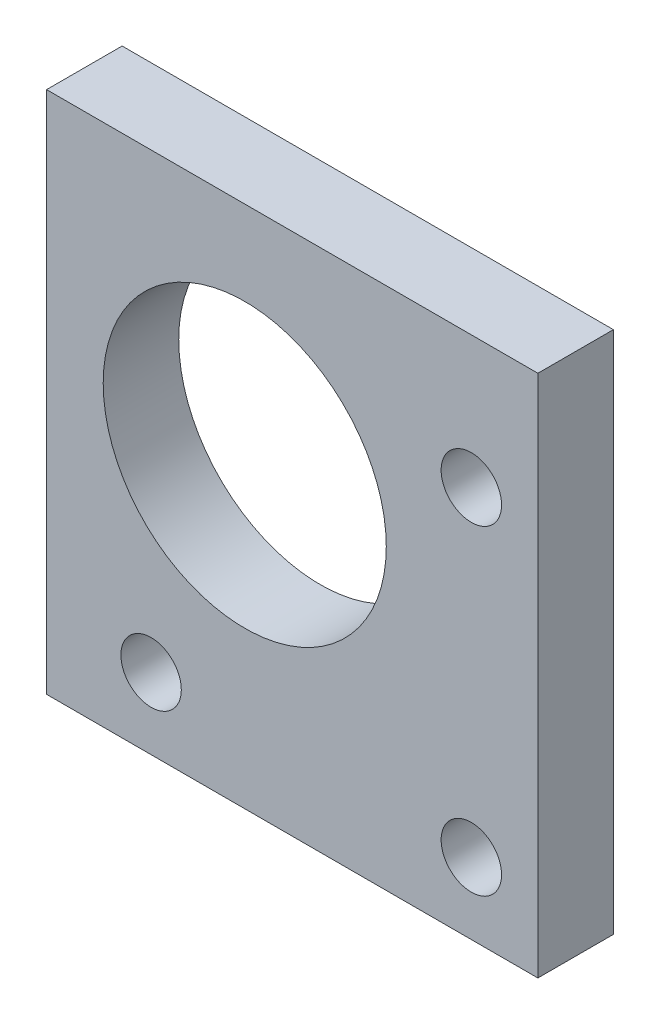
ISO-10303-21;
HEADER;
FILE_DESCRIPTION(('STEP AP214'),'2;1');
FILE_NAME('part.step','',(''),(''),'','','');
FILE_SCHEMA(('AUTOMOTIVE_DESIGN { 1 0 10303 214 1 1 1 1 }'));
ENDSEC;
DATA;
#1=APPLICATION_CONTEXT('core data for automotive mechanical design processes');
#2=APPLICATION_PROTOCOL_DEFINITION('international standard','automotive_design',2000,#1);
#3=PRODUCT_CONTEXT('',#1,'mechanical');
#4=PRODUCT('Part','Part','',(#3));
#5=PRODUCT_RELATED_PRODUCT_CATEGORY('part','',(#4));
#6=PRODUCT_DEFINITION_FORMATION('','',#4);
#7=PRODUCT_DEFINITION_CONTEXT('part definition',#1,'design');
#8=PRODUCT_DEFINITION('design','',#6,#7);
#9=PRODUCT_DEFINITION_SHAPE('','',#8);
#10=(LENGTH_UNIT() NAMED_UNIT(*) SI_UNIT(.MILLI.,.METRE.));
#11=(NAMED_UNIT(*) PLANE_ANGLE_UNIT() SI_UNIT($,.RADIAN.));
#12=(NAMED_UNIT(*) SI_UNIT($,.STERADIAN.) SOLID_ANGLE_UNIT());
#13=UNCERTAINTY_MEASURE_WITH_UNIT(LENGTH_MEASURE(1.E-05),#10,'distance_accuracy_value','');
#14=(GEOMETRIC_REPRESENTATION_CONTEXT(3) GLOBAL_UNCERTAINTY_ASSIGNED_CONTEXT((#13)) GLOBAL_UNIT_ASSIGNED_CONTEXT((#10,
#11,#12)) REPRESENTATION_CONTEXT('',''));
#15=CARTESIAN_POINT('',(0.,0.,0.));
#16=DIRECTION('',(0.,0.,1.));
#17=DIRECTION('',(1.,0.,0.));
#18=AXIS2_PLACEMENT_3D('',#15,#16,#17);
#19=CARTESIAN_POINT('',(0.,0.,6.35));
#20=DIRECTION('',(0.,0.,1.));
#21=DIRECTION('',(1.,0.,0.));
#22=AXIS2_PLACEMENT_3D('',#19,#20,#21);
#23=PLANE('',#22);
#24=CARTESIAN_POINT('',(19.05,-19.05,6.35));
#25=DIRECTION('',(0.,0.,1.));
#26=DIRECTION('',(1.,0.,0.));
#27=AXIS2_PLACEMENT_3D('',#24,#25,#26);
#28=CIRCLE('',#27,2.54);
#29=CARTESIAN_POINT('',(21.59,-19.05,6.35));
#30=VERTEX_POINT('',#29);
#31=EDGE_CURVE('E122',#30,#30,#28,.T.);
#32=ORIENTED_EDGE('',*,*,#31,.F.);
#33=EDGE_LOOP('',(#32));
#34=FACE_BOUND('',#33,.T.);
#35=CARTESIAN_POINT('',(0.,0.,6.35));
#36=DIRECTION('',(0.,0.,1.));
#37=DIRECTION('',(1.,0.,0.));
#38=AXIS2_PLACEMENT_3D('',#35,#36,#37);
#39=CIRCLE('',#38,11.8999);
#40=CARTESIAN_POINT('',(11.8999,0.,6.35));
#41=VERTEX_POINT('',#40);
#42=EDGE_CURVE('E101',#41,#41,#39,.T.);
#43=ORIENTED_EDGE('',*,*,#42,.F.);
#44=EDGE_LOOP('',(#43));
#45=FACE_BOUND('',#44,.T.);
#46=DIRECTION('',(0.,1.,0.));
#47=VECTOR('',#46,1.);
#48=CARTESIAN_POINT('',(24.6441907260092,-25.0415711370855,6.35));
#49=LINE('',#48,#47);
#50=CARTESIAN_POINT('',(24.6441907260092,-25.0415711370855,6.35));
#51=VERTEX_POINT('',#50);
#52=CARTESIAN_POINT('',(24.6441907260092,18.9902397011958,6.35));
#53=VERTEX_POINT('',#52);
#54=EDGE_CURVE('E86',#51,#53,#49,.T.);
#55=ORIENTED_EDGE('',*,*,#54,.T.);
#56=DIRECTION('',(-1.,0.,0.));
#57=VECTOR('',#56,1.);
#58=CARTESIAN_POINT('',(24.6441907260092,18.9902397011958,6.35));
#59=LINE('',#58,#57);
#60=CARTESIAN_POINT('',(-16.659153201353,18.9902397011958,6.35));
#61=VERTEX_POINT('',#60);
#62=EDGE_CURVE('E81',#53,#61,#59,.T.);
#63=ORIENTED_EDGE('',*,*,#62,.T.);
#64=DIRECTION('',(0.,-1.,0.));
#65=VECTOR('',#64,1.);
#66=CARTESIAN_POINT('',(-16.659153201353,-25.0415711370855,6.35));
#67=LINE('',#66,#65);
#68=CARTESIAN_POINT('',(-16.659153201353,-25.0415711370855,6.35));
#69=VERTEX_POINT('',#68);
#70=EDGE_CURVE('E84',#61,#69,#67,.T.);
#71=ORIENTED_EDGE('',*,*,#70,.T.);
#72=DIRECTION('',(1.,0.,0.));
#73=VECTOR('',#72,1.);
#74=CARTESIAN_POINT('',(24.6441907260092,-25.0415711370855,6.35));
#75=LINE('',#74,#73);
#76=EDGE_CURVE('E51',#69,#51,#75,.T.);
#77=ORIENTED_EDGE('',*,*,#76,.T.);
#78=EDGE_LOOP('',(#55,#63,#71,#77));
#79=FACE_BOUND('',#78,.T.);
#80=CARTESIAN_POINT('',(19.05,7.874,6.35));
#81=DIRECTION('',(0.,0.,1.));
#82=DIRECTION('',(1.,0.,0.));
#83=AXIS2_PLACEMENT_3D('',#80,#81,#82);
#84=CIRCLE('',#83,2.54);
#85=CARTESIAN_POINT('',(21.59,7.874,6.35));
#86=VERTEX_POINT('',#85);
#87=EDGE_CURVE('E116',#86,#86,#84,.T.);
#88=ORIENTED_EDGE('',*,*,#87,.F.);
#89=EDGE_LOOP('',(#88));
#90=FACE_BOUND('',#89,.T.);
#91=CARTESIAN_POINT('',(-7.874,-19.05,6.35));
#92=DIRECTION('',(0.,0.,1.));
#93=DIRECTION('',(1.,0.,0.));
#94=AXIS2_PLACEMENT_3D('',#91,#92,#93);
#95=CIRCLE('',#94,2.54);
#96=CARTESIAN_POINT('',(-5.334,-19.05,6.35));
#97=VERTEX_POINT('',#96);
#98=EDGE_CURVE('E128',#97,#97,#95,.T.);
#99=ORIENTED_EDGE('',*,*,#98,.F.);
#100=EDGE_LOOP('',(#99));
#101=FACE_BOUND('',#100,.T.);
#102=ADVANCED_FACE('F34',(#34,#45,#79,#90,#101),#23,.T.);
#103=CARTESIAN_POINT('',(0.,0.,0.));
#104=DIRECTION('',(0.,0.,1.));
#105=DIRECTION('',(1.,0.,0.));
#106=AXIS2_PLACEMENT_3D('',#103,#104,#105);
#107=PLANE('',#106);
#108=CARTESIAN_POINT('',(19.05,-19.05,0.));
#109=DIRECTION('',(0.,0.,1.));
#110=DIRECTION('',(1.,0.,0.));
#111=AXIS2_PLACEMENT_3D('',#108,#109,#110);
#112=CIRCLE('',#111,2.54);
#113=CARTESIAN_POINT('',(21.59,-19.05,0.));
#114=VERTEX_POINT('',#113);
#115=EDGE_CURVE('E125',#114,#114,#112,.T.);
#116=ORIENTED_EDGE('',*,*,#115,.T.);
#117=EDGE_LOOP('',(#116));
#118=FACE_BOUND('',#117,.T.);
#119=CARTESIAN_POINT('',(0.,0.,0.));
#120=DIRECTION('',(0.,0.,1.));
#121=DIRECTION('',(1.,0.,0.));
#122=AXIS2_PLACEMENT_3D('',#119,#120,#121);
#123=CIRCLE('',#122,11.8999);
#124=CARTESIAN_POINT('',(11.8999,0.,0.));
#125=VERTEX_POINT('',#124);
#126=EDGE_CURVE('E113',#125,#125,#123,.T.);
#127=ORIENTED_EDGE('',*,*,#126,.T.);
#128=EDGE_LOOP('',(#127));
#129=FACE_BOUND('',#128,.T.);
#130=DIRECTION('',(0.,1.,0.));
#131=VECTOR('',#130,1.);
#132=CARTESIAN_POINT('',(24.6441907260092,-25.0415711370855,0.));
#133=LINE('',#132,#131);
#134=CARTESIAN_POINT('',(24.6441907260092,-25.0415711370855,0.));
#135=VERTEX_POINT('',#134);
#136=CARTESIAN_POINT('',(24.6441907260092,18.9902397011958,0.));
#137=VERTEX_POINT('',#136);
#138=EDGE_CURVE('E98',#135,#137,#133,.T.);
#139=ORIENTED_EDGE('',*,*,#138,.F.);
#140=DIRECTION('',(1.,0.,0.));
#141=VECTOR('',#140,1.);
#142=CARTESIAN_POINT('',(24.6441907260092,-25.0415711370855,0.));
#143=LINE('',#142,#141);
#144=CARTESIAN_POINT('',(-16.659153201353,-25.0415711370855,0.));
#145=VERTEX_POINT('',#144);
#146=EDGE_CURVE('E74',#145,#135,#143,.T.);
#147=ORIENTED_EDGE('',*,*,#146,.F.);
#148=DIRECTION('',(0.,-1.,0.));
#149=VECTOR('',#148,1.);
#150=CARTESIAN_POINT('',(-16.659153201353,-25.0415711370855,0.));
#151=LINE('',#150,#149);
#152=CARTESIAN_POINT('',(-16.659153201353,18.9902397011958,0.));
#153=VERTEX_POINT('',#152);
#154=EDGE_CURVE('E68',#153,#145,#151,.T.);
#155=ORIENTED_EDGE('',*,*,#154,.F.);
#156=DIRECTION('',(-1.,0.,0.));
#157=VECTOR('',#156,1.);
#158=CARTESIAN_POINT('',(24.6441907260092,18.9902397011958,0.));
#159=LINE('',#158,#157);
#160=EDGE_CURVE('E90',#137,#153,#159,.T.);
#161=ORIENTED_EDGE('',*,*,#160,.F.);
#162=EDGE_LOOP('',(#139,#147,#155,#161));
#163=FACE_BOUND('',#162,.T.);
#164=CARTESIAN_POINT('',(19.05,7.874,0.));
#165=DIRECTION('',(0.,0.,1.));
#166=DIRECTION('',(1.,0.,0.));
#167=AXIS2_PLACEMENT_3D('',#164,#165,#166);
#168=CIRCLE('',#167,2.54);
#169=CARTESIAN_POINT('',(21.59,7.874,0.));
#170=VERTEX_POINT('',#169);
#171=EDGE_CURVE('E119',#170,#170,#168,.T.);
#172=ORIENTED_EDGE('',*,*,#171,.T.);
#173=EDGE_LOOP('',(#172));
#174=FACE_BOUND('',#173,.T.);
#175=CARTESIAN_POINT('',(-7.874,-19.05,0.));
#176=DIRECTION('',(0.,0.,1.));
#177=DIRECTION('',(1.,0.,0.));
#178=AXIS2_PLACEMENT_3D('',#175,#176,#177);
#179=CIRCLE('',#178,2.54);
#180=CARTESIAN_POINT('',(-5.334,-19.05,0.));
#181=VERTEX_POINT('',#180);
#182=EDGE_CURVE('E131',#181,#181,#179,.T.);
#183=ORIENTED_EDGE('',*,*,#182,.T.);
#184=EDGE_LOOP('',(#183));
#185=FACE_BOUND('',#184,.T.);
#186=ADVANCED_FACE('F109',(#118,#129,#163,#174,#185),#107,.F.);
#187=CARTESIAN_POINT('',(24.6441907260092,-25.0415711370855,6.35));
#188=DIRECTION('',(-1.,0.,0.));
#189=DIRECTION('',(0.,0.,1.));
#190=AXIS2_PLACEMENT_3D('',#187,#188,#189);
#191=PLANE('',#190);
#192=ORIENTED_EDGE('',*,*,#138,.T.);
#193=DIRECTION('',(0.,0.,-1.));
#194=VECTOR('',#193,1.);
#195=CARTESIAN_POINT('',(24.6441907260092,18.9902397011958,6.35));
#196=LINE('',#195,#194);
#197=EDGE_CURVE('E11',#53,#137,#196,.T.);
#198=ORIENTED_EDGE('',*,*,#197,.F.);
#199=ORIENTED_EDGE('',*,*,#54,.F.);
#200=DIRECTION('',(0.,0.,-1.));
#201=VECTOR('',#200,1.);
#202=CARTESIAN_POINT('',(24.6441907260092,-25.0415711370855,6.35));
#203=LINE('',#202,#201);
#204=EDGE_CURVE('E94',#51,#135,#203,.T.);
#205=ORIENTED_EDGE('',*,*,#204,.T.);
#206=EDGE_LOOP('',(#192,#198,#199,#205));
#207=FACE_BOUND('',#206,.T.);
#208=ADVANCED_FACE('F36',(#207),#191,.F.);
#209=CARTESIAN_POINT('',(24.6441907260092,18.9902397011958,6.35));
#210=DIRECTION('',(0.,-1.,0.));
#211=DIRECTION('',(0.,0.,-1.));
#212=AXIS2_PLACEMENT_3D('',#209,#210,#211);
#213=PLANE('',#212);
#214=ORIENTED_EDGE('',*,*,#160,.T.);
#215=DIRECTION('',(0.,0.,-1.));
#216=VECTOR('',#215,1.);
#217=CARTESIAN_POINT('',(-16.659153201353,18.9902397011958,6.35));
#218=LINE('',#217,#216);
#219=EDGE_CURVE('E43',#61,#153,#218,.T.);
#220=ORIENTED_EDGE('',*,*,#219,.F.);
#221=ORIENTED_EDGE('',*,*,#62,.F.);
#222=ORIENTED_EDGE('',*,*,#197,.T.);
#223=EDGE_LOOP('',(#214,#220,#221,#222));
#224=FACE_BOUND('',#223,.T.);
#225=ADVANCED_FACE('F89',(#224),#213,.F.);
#226=CARTESIAN_POINT('',(-16.659153201353,-25.0415711370855,6.35));
#227=DIRECTION('',(1.,0.,0.));
#228=DIRECTION('',(0.,0.,-1.));
#229=AXIS2_PLACEMENT_3D('',#226,#227,#228);
#230=PLANE('',#229);
#231=ORIENTED_EDGE('',*,*,#154,.T.);
#232=DIRECTION('',(0.,0.,-1.));
#233=VECTOR('',#232,1.);
#234=CARTESIAN_POINT('',(-16.659153201353,-25.0415711370855,6.35));
#235=LINE('',#234,#233);
#236=EDGE_CURVE('E91',#69,#145,#235,.T.);
#237=ORIENTED_EDGE('',*,*,#236,.F.);
#238=ORIENTED_EDGE('',*,*,#70,.F.);
#239=ORIENTED_EDGE('',*,*,#219,.T.);
#240=EDGE_LOOP('',(#231,#237,#238,#239));
#241=FACE_BOUND('',#240,.T.);
#242=ADVANCED_FACE('F92',(#241),#230,.F.);
#243=CARTESIAN_POINT('',(24.6441907260092,-25.0415711370855,6.35));
#244=DIRECTION('',(0.,1.,0.));
#245=DIRECTION('',(0.,0.,1.));
#246=AXIS2_PLACEMENT_3D('',#243,#244,#245);
#247=PLANE('',#246);
#248=ORIENTED_EDGE('',*,*,#146,.T.);
#249=ORIENTED_EDGE('',*,*,#204,.F.);
#250=ORIENTED_EDGE('',*,*,#76,.F.);
#251=ORIENTED_EDGE('',*,*,#236,.T.);
#252=EDGE_LOOP('',(#248,#249,#250,#251));
#253=FACE_BOUND('',#252,.T.);
#254=ADVANCED_FACE('F106',(#253),#247,.F.);
#255=CARTESIAN_POINT('',(0.,0.,6.35));
#256=DIRECTION('',(0.,0.,-1.));
#257=DIRECTION('',(-1.,0.,0.));
#258=AXIS2_PLACEMENT_3D('',#255,#256,#257);
#259=CYLINDRICAL_SURFACE('',#258,11.8999);
#260=ORIENTED_EDGE('',*,*,#42,.T.);
#261=EDGE_LOOP('',(#260));
#262=FACE_BOUND('',#261,.T.);
#263=ORIENTED_EDGE('',*,*,#126,.F.);
#264=EDGE_LOOP('',(#263));
#265=FACE_BOUND('',#264,.T.);
#266=ADVANCED_FACE('F151',(#262,#265),#259,.F.);
#267=CARTESIAN_POINT('',(19.05,7.874,6.35));
#268=DIRECTION('',(0.,0.,-1.));
#269=DIRECTION('',(-1.,0.,0.));
#270=AXIS2_PLACEMENT_3D('',#267,#268,#269);
#271=CYLINDRICAL_SURFACE('',#270,2.54);
#272=ORIENTED_EDGE('',*,*,#87,.T.);
#273=EDGE_LOOP('',(#272));
#274=FACE_BOUND('',#273,.T.);
#275=ORIENTED_EDGE('',*,*,#171,.F.);
#276=EDGE_LOOP('',(#275));
#277=FACE_BOUND('',#276,.T.);
#278=ADVANCED_FACE('F197',(#274,#277),#271,.F.);
#279=CARTESIAN_POINT('',(19.05,-19.05,6.35));
#280=DIRECTION('',(0.,0.,-1.));
#281=DIRECTION('',(-1.,0.,0.));
#282=AXIS2_PLACEMENT_3D('',#279,#280,#281);
#283=CYLINDRICAL_SURFACE('',#282,2.54);
#284=ORIENTED_EDGE('',*,*,#31,.T.);
#285=EDGE_LOOP('',(#284));
#286=FACE_BOUND('',#285,.T.);
#287=ORIENTED_EDGE('',*,*,#115,.F.);
#288=EDGE_LOOP('',(#287));
#289=FACE_BOUND('',#288,.T.);
#290=ADVANCED_FACE('F205',(#286,#289),#283,.F.);
#291=CARTESIAN_POINT('',(-7.874,-19.05,6.35));
#292=DIRECTION('',(0.,0.,-1.));
#293=DIRECTION('',(-1.,0.,0.));
#294=AXIS2_PLACEMENT_3D('',#291,#292,#293);
#295=CYLINDRICAL_SURFACE('',#294,2.54);
#296=ORIENTED_EDGE('',*,*,#98,.T.);
#297=EDGE_LOOP('',(#296));
#298=FACE_BOUND('',#297,.T.);
#299=ORIENTED_EDGE('',*,*,#182,.F.);
#300=EDGE_LOOP('',(#299));
#301=FACE_BOUND('',#300,.T.);
#302=ADVANCED_FACE('F137',(#298,#301),#295,.F.);
#303=CLOSED_SHELL('',(#102,#186,#208,#225,#242,#254,#266,#278,#290,#302));
#304=MANIFOLD_SOLID_BREP('B2',#303);
#305=ADVANCED_BREP_SHAPE_REPRESENTATION('',(#18,#304),#14);
#306=SHAPE_DEFINITION_REPRESENTATION(#9,#305);
ENDSEC;
END-ISO-10303-21;
